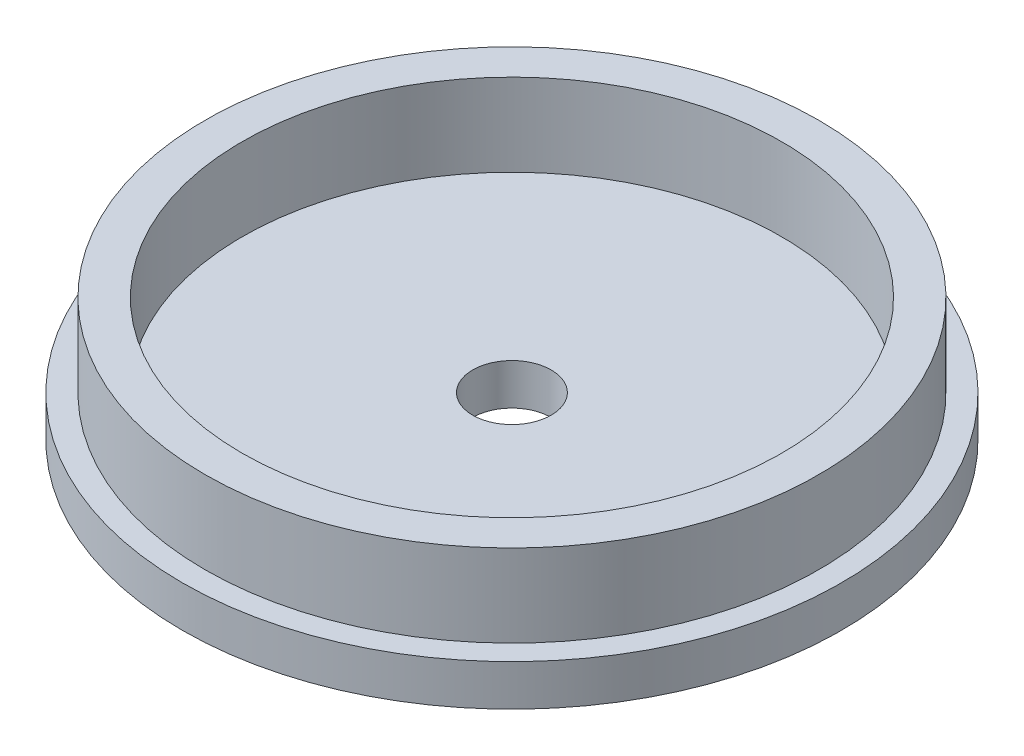
ISO-10303-21;
HEADER;
FILE_DESCRIPTION(('STEP AP214'),'2;1');
FILE_NAME('part.step','',(''),(''),'','','');
FILE_SCHEMA(('AUTOMOTIVE_DESIGN { 1 0 10303 214 1 1 1 1 }'));
ENDSEC;
DATA;
#1=APPLICATION_CONTEXT('core data for automotive mechanical design processes');
#2=APPLICATION_PROTOCOL_DEFINITION('international standard','automotive_design',2000,#1);
#3=PRODUCT_CONTEXT('',#1,'mechanical');
#4=PRODUCT('Part','Part','',(#3));
#5=PRODUCT_RELATED_PRODUCT_CATEGORY('part','',(#4));
#6=PRODUCT_DEFINITION_FORMATION('','',#4);
#7=PRODUCT_DEFINITION_CONTEXT('part definition',#1,'design');
#8=PRODUCT_DEFINITION('design','',#6,#7);
#9=PRODUCT_DEFINITION_SHAPE('','',#8);
#10=(LENGTH_UNIT() NAMED_UNIT(*) SI_UNIT(.MILLI.,.METRE.));
#11=(NAMED_UNIT(*) PLANE_ANGLE_UNIT() SI_UNIT($,.RADIAN.));
#12=(NAMED_UNIT(*) SI_UNIT($,.STERADIAN.) SOLID_ANGLE_UNIT());
#13=UNCERTAINTY_MEASURE_WITH_UNIT(LENGTH_MEASURE(1.E-05),#10,'distance_accuracy_value','');
#14=(GEOMETRIC_REPRESENTATION_CONTEXT(3) GLOBAL_UNCERTAINTY_ASSIGNED_CONTEXT((#13)) GLOBAL_UNIT_ASSIGNED_CONTEXT((#10,
#11,#12)) REPRESENTATION_CONTEXT('',''));
#15=CARTESIAN_POINT('',(0.,0.,0.));
#16=DIRECTION('',(0.,0.,1.));
#17=DIRECTION('',(1.,0.,0.));
#18=AXIS2_PLACEMENT_3D('',#15,#16,#17);
#19=CARTESIAN_POINT('',(0.,-5.,0.));
#20=DIRECTION('',(0.,1.,0.));
#21=DIRECTION('',(0.,0.,1.));
#22=AXIS2_PLACEMENT_3D('',#19,#20,#21);
#23=CYLINDRICAL_SURFACE('',#22,40.);
#24=CARTESIAN_POINT('',(0.,-5.,0.));
#25=DIRECTION('',(0.,1.,0.));
#26=DIRECTION('',(0.,0.,1.));
#27=AXIS2_PLACEMENT_3D('',#24,#25,#26);
#28=CIRCLE('',#27,40.);
#29=CARTESIAN_POINT('',(0.,-5.,40.));
#30=VERTEX_POINT('',#29);
#31=EDGE_CURVE('E53',#30,#30,#28,.T.);
#32=ORIENTED_EDGE('',*,*,#31,.T.);
#33=EDGE_LOOP('',(#32));
#34=FACE_BOUND('',#33,.T.);
#35=CARTESIAN_POINT('',(0.,0.,0.));
#36=DIRECTION('',(0.,1.,0.));
#37=DIRECTION('',(0.,0.,1.));
#38=AXIS2_PLACEMENT_3D('',#35,#36,#37);
#39=CIRCLE('',#38,40.);
#40=CARTESIAN_POINT('',(0.,0.,40.));
#41=VERTEX_POINT('',#40);
#42=EDGE_CURVE('E48',#41,#41,#39,.T.);
#43=ORIENTED_EDGE('',*,*,#42,.F.);
#44=EDGE_LOOP('',(#43));
#45=FACE_BOUND('',#44,.T.);
#46=ADVANCED_FACE('F45',(#34,#45),#23,.T.);
#47=CARTESIAN_POINT('',(0.,-5.,0.));
#48=DIRECTION('',(0.,1.,0.));
#49=DIRECTION('',(0.,0.,1.));
#50=AXIS2_PLACEMENT_3D('',#47,#48,#49);
#51=PLANE('',#50);
#52=CARTESIAN_POINT('',(0.,-5.,0.));
#53=DIRECTION('',(0.,1.,0.));
#54=DIRECTION('',(0.,0.,1.));
#55=AXIS2_PLACEMENT_3D('',#52,#53,#54);
#56=CIRCLE('',#55,4.7625);
#57=CARTESIAN_POINT('',(0.,-5.,4.7625));
#58=VERTEX_POINT('',#57);
#59=EDGE_CURVE('E69',#58,#58,#56,.T.);
#60=ORIENTED_EDGE('',*,*,#59,.T.);
#61=EDGE_LOOP('',(#60));
#62=FACE_BOUND('',#61,.T.);
#63=ORIENTED_EDGE('',*,*,#31,.F.);
#64=EDGE_LOOP('',(#63));
#65=FACE_BOUND('',#64,.T.);
#66=ADVANCED_FACE('F109',(#62,#65),#51,.F.);
#67=CARTESIAN_POINT('',(0.,0.,0.));
#68=DIRECTION('',(0.,1.,0.));
#69=DIRECTION('',(0.,0.,1.));
#70=AXIS2_PLACEMENT_3D('',#67,#68,#69);
#71=PLANE('',#70);
#72=CARTESIAN_POINT('',(0.,0.,0.));
#73=DIRECTION('',(0.,1.,0.));
#74=DIRECTION('',(0.,0.,1.));
#75=AXIS2_PLACEMENT_3D('',#72,#73,#74);
#76=CIRCLE('',#75,37.25);
#77=CARTESIAN_POINT('',(0.,0.,37.25));
#78=VERTEX_POINT('',#77);
#79=EDGE_CURVE('E10',#78,#78,#76,.T.);
#80=ORIENTED_EDGE('',*,*,#79,.F.);
#81=EDGE_LOOP('',(#80));
#82=FACE_BOUND('',#81,.T.);
#83=ORIENTED_EDGE('',*,*,#42,.T.);
#84=EDGE_LOOP('',(#83));
#85=FACE_BOUND('',#84,.T.);
#86=ADVANCED_FACE('F104',(#82,#85),#71,.T.);
#87=CARTESIAN_POINT('',(0.,10.,0.));
#88=DIRECTION('',(0.,-1.,0.));
#89=DIRECTION('',(0.,0.,-1.));
#90=AXIS2_PLACEMENT_3D('',#87,#88,#89);
#91=CYLINDRICAL_SURFACE('',#90,37.25);
#92=CARTESIAN_POINT('',(0.,10.,0.));
#93=DIRECTION('',(0.,1.,0.));
#94=DIRECTION('',(0.,0.,1.));
#95=AXIS2_PLACEMENT_3D('',#92,#93,#94);
#96=CIRCLE('',#95,37.25);
#97=CARTESIAN_POINT('',(0.,10.,37.25));
#98=VERTEX_POINT('',#97);
#99=EDGE_CURVE('E60',#98,#98,#96,.T.);
#100=ORIENTED_EDGE('',*,*,#99,.F.);
#101=EDGE_LOOP('',(#100));
#102=FACE_BOUND('',#101,.T.);
#103=ORIENTED_EDGE('',*,*,#79,.T.);
#104=EDGE_LOOP('',(#103));
#105=FACE_BOUND('',#104,.T.);
#106=ADVANCED_FACE('F99',(#102,#105),#91,.T.);
#107=CARTESIAN_POINT('',(0.,10.,0.));
#108=DIRECTION('',(0.,1.,0.));
#109=DIRECTION('',(0.,0.,1.));
#110=AXIS2_PLACEMENT_3D('',#107,#108,#109);
#111=PLANE('',#110);
#112=CARTESIAN_POINT('',(0.,10.,0.));
#113=DIRECTION('',(0.,1.,0.));
#114=DIRECTION('',(0.,0.,1.));
#115=AXIS2_PLACEMENT_3D('',#112,#113,#114);
#116=CIRCLE('',#115,32.7500111873006);
#117=CARTESIAN_POINT('',(0.,10.,32.7500111873006));
#118=VERTEX_POINT('',#117);
#119=EDGE_CURVE('E65',#118,#118,#116,.T.);
#120=ORIENTED_EDGE('',*,*,#119,.F.);
#121=EDGE_LOOP('',(#120));
#122=FACE_BOUND('',#121,.T.);
#123=ORIENTED_EDGE('',*,*,#99,.T.);
#124=EDGE_LOOP('',(#123));
#125=FACE_BOUND('',#124,.T.);
#126=ADVANCED_FACE('F93',(#122,#125),#111,.T.);
#127=CARTESIAN_POINT('',(0.,0.,0.));
#128=DIRECTION('',(0.,1.,0.));
#129=DIRECTION('',(0.,0.,1.));
#130=AXIS2_PLACEMENT_3D('',#127,#128,#129);
#131=CYLINDRICAL_SURFACE('',#130,32.7500111873006);
#132=CARTESIAN_POINT('',(0.,0.,0.));
#133=DIRECTION('',(0.,1.,0.));
#134=DIRECTION('',(0.,0.,1.));
#135=AXIS2_PLACEMENT_3D('',#132,#133,#134);
#136=CIRCLE('',#135,32.7500111873006);
#137=CARTESIAN_POINT('',(0.,0.,32.7500111873006));
#138=VERTEX_POINT('',#137);
#139=EDGE_CURVE('E64',#138,#138,#136,.T.);
#140=ORIENTED_EDGE('',*,*,#139,.F.);
#141=EDGE_LOOP('',(#140));
#142=FACE_BOUND('',#141,.T.);
#143=ORIENTED_EDGE('',*,*,#119,.T.);
#144=EDGE_LOOP('',(#143));
#145=FACE_BOUND('',#144,.T.);
#146=ADVANCED_FACE('F87',(#142,#145),#131,.F.);
#147=CARTESIAN_POINT('',(0.,0.,0.));
#148=DIRECTION('',(0.,1.,0.));
#149=DIRECTION('',(0.,0.,1.));
#150=AXIS2_PLACEMENT_3D('',#147,#148,#149);
#151=PLANE('',#150);
#152=CARTESIAN_POINT('',(0.,0.,0.));
#153=DIRECTION('',(0.,1.,0.));
#154=DIRECTION('',(0.,0.,1.));
#155=AXIS2_PLACEMENT_3D('',#152,#153,#154);
#156=CIRCLE('',#155,4.7625);
#157=CARTESIAN_POINT('',(0.,0.,4.7625));
#158=VERTEX_POINT('',#157);
#159=EDGE_CURVE('E76',#158,#158,#156,.T.);
#160=ORIENTED_EDGE('',*,*,#159,.F.);
#161=EDGE_LOOP('',(#160));
#162=FACE_BOUND('',#161,.T.);
#163=ORIENTED_EDGE('',*,*,#139,.T.);
#164=EDGE_LOOP('',(#163));
#165=FACE_BOUND('',#164,.T.);
#166=ADVANCED_FACE('F84',(#162,#165),#151,.T.);
#167=CARTESIAN_POINT('',(0.,-10.,0.));
#168=DIRECTION('',(0.,1.,0.));
#169=DIRECTION('',(0.,0.,1.));
#170=AXIS2_PLACEMENT_3D('',#167,#168,#169);
#171=CYLINDRICAL_SURFACE('',#170,4.7625);
#172=ORIENTED_EDGE('',*,*,#159,.T.);
#173=EDGE_LOOP('',(#172));
#174=FACE_BOUND('',#173,.T.);
#175=ORIENTED_EDGE('',*,*,#59,.F.);
#176=EDGE_LOOP('',(#175));
#177=FACE_BOUND('',#176,.T.);
#178=ADVANCED_FACE('F81',(#174,#177),#171,.F.);
#179=CLOSED_SHELL('',(#46,#66,#86,#106,#126,#146,#166,#178));
#180=MANIFOLD_SOLID_BREP('B2',#179);
#181=ADVANCED_BREP_SHAPE_REPRESENTATION('',(#18,#180),#14);
#182=SHAPE_DEFINITION_REPRESENTATION(#9,#181);
ENDSEC;
END-ISO-10303-21;
